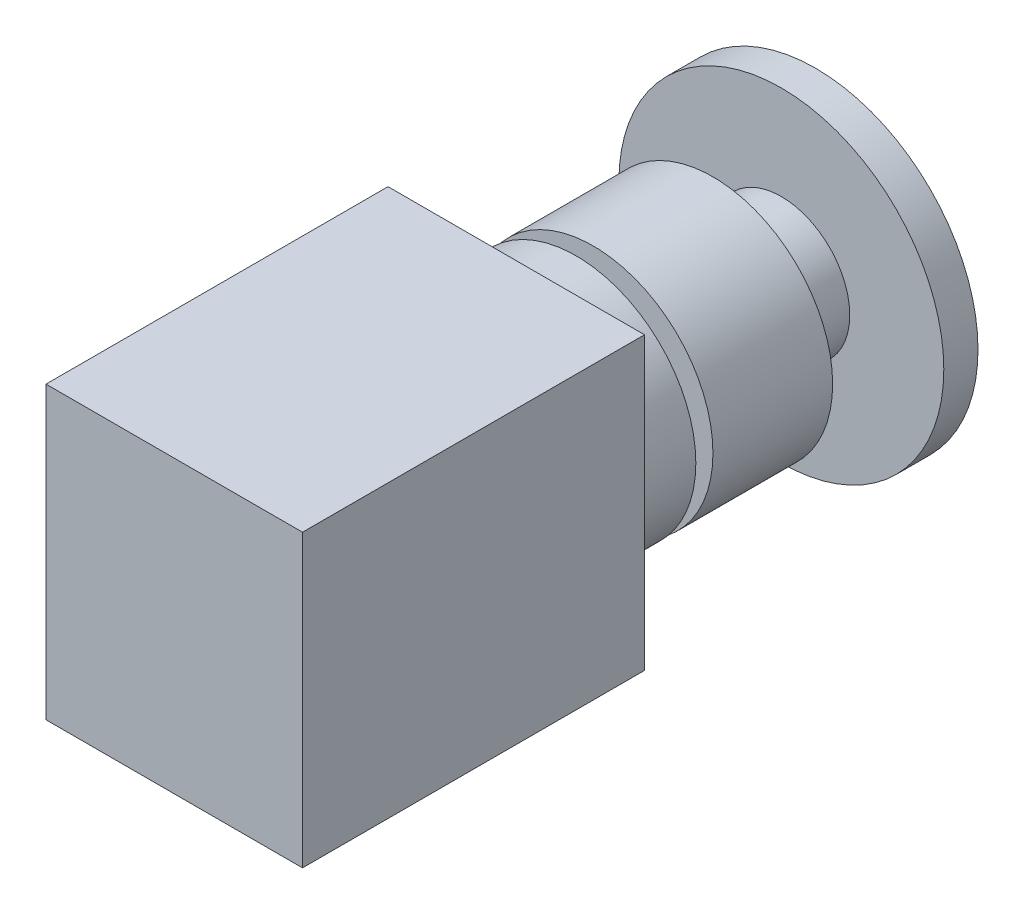
ISO-10303-21;
HEADER;
FILE_DESCRIPTION(('STEP AP214'),'2;1');
FILE_NAME('part.step','',(''),(''),'','','');
FILE_SCHEMA(('AUTOMOTIVE_DESIGN { 1 0 10303 214 1 1 1 1 }'));
ENDSEC;
DATA;
#1=APPLICATION_CONTEXT('core data for automotive mechanical design processes');
#2=APPLICATION_PROTOCOL_DEFINITION('international standard','automotive_design',2000,#1);
#3=PRODUCT_CONTEXT('',#1,'mechanical');
#4=PRODUCT('Part','Part','',(#3));
#5=PRODUCT_RELATED_PRODUCT_CATEGORY('part','',(#4));
#6=PRODUCT_DEFINITION_FORMATION('','',#4);
#7=PRODUCT_DEFINITION_CONTEXT('part definition',#1,'design');
#8=PRODUCT_DEFINITION('design','',#6,#7);
#9=PRODUCT_DEFINITION_SHAPE('','',#8);
#10=(LENGTH_UNIT() NAMED_UNIT(*) SI_UNIT(.MILLI.,.METRE.));
#11=(NAMED_UNIT(*) PLANE_ANGLE_UNIT() SI_UNIT($,.RADIAN.));
#12=(NAMED_UNIT(*) SI_UNIT($,.STERADIAN.) SOLID_ANGLE_UNIT());
#13=UNCERTAINTY_MEASURE_WITH_UNIT(LENGTH_MEASURE(1.E-05),#10,'distance_accuracy_value','');
#14=(GEOMETRIC_REPRESENTATION_CONTEXT(3) GLOBAL_UNCERTAINTY_ASSIGNED_CONTEXT((#13)) GLOBAL_UNIT_ASSIGNED_CONTEXT((#10,
#11,#12)) REPRESENTATION_CONTEXT('',''));
#15=CARTESIAN_POINT('',(0.,0.,0.));
#16=DIRECTION('',(0.,0.,1.));
#17=DIRECTION('',(1.,0.,0.));
#18=AXIS2_PLACEMENT_3D('',#15,#16,#17);
#19=CARTESIAN_POINT('',(0.,0.,4.));
#20=DIRECTION('',(0.,0.,-1.));
#21=DIRECTION('',(-1.,0.,0.));
#22=AXIS2_PLACEMENT_3D('',#19,#20,#21);
#23=CYLINDRICAL_SURFACE('',#22,19.);
#24=CARTESIAN_POINT('',(0.,0.,4.));
#25=DIRECTION('',(0.,0.,1.));
#26=DIRECTION('',(1.,0.,0.));
#27=AXIS2_PLACEMENT_3D('',#24,#25,#26);
#28=CIRCLE('',#27,19.);
#29=CARTESIAN_POINT('',(19.,0.,4.));
#30=VERTEX_POINT('',#29);
#31=EDGE_CURVE('E11',#30,#30,#28,.T.);
#32=ORIENTED_EDGE('',*,*,#31,.F.);
#33=EDGE_LOOP('',(#32));
#34=FACE_BOUND('',#33,.T.);
#35=CARTESIAN_POINT('',(0.,0.,0.));
#36=DIRECTION('',(0.,0.,1.));
#37=DIRECTION('',(1.,0.,0.));
#38=AXIS2_PLACEMENT_3D('',#35,#36,#37);
#39=CIRCLE('',#38,19.);
#40=CARTESIAN_POINT('',(19.,0.,0.));
#41=VERTEX_POINT('',#40);
#42=EDGE_CURVE('E38',#41,#41,#39,.T.);
#43=ORIENTED_EDGE('',*,*,#42,.T.);
#44=EDGE_LOOP('',(#43));
#45=FACE_BOUND('',#44,.T.);
#46=ADVANCED_FACE('F35',(#34,#45),#23,.T.);
#47=CARTESIAN_POINT('',(0.,0.,4.));
#48=DIRECTION('',(0.,0.,1.));
#49=DIRECTION('',(1.,0.,0.));
#50=AXIS2_PLACEMENT_3D('',#47,#48,#49);
#51=PLANE('',#50);
#52=CARTESIAN_POINT('',(0.,0.,4.));
#53=DIRECTION('',(0.,0.,1.));
#54=DIRECTION('',(1.,0.,0.));
#55=AXIS2_PLACEMENT_3D('',#52,#53,#54);
#56=CIRCLE('',#55,8.);
#57=CARTESIAN_POINT('',(8.,0.,4.));
#58=VERTEX_POINT('',#57);
#59=EDGE_CURVE('E127',#58,#58,#56,.T.);
#60=ORIENTED_EDGE('',*,*,#59,.F.);
#61=EDGE_LOOP('',(#60));
#62=FACE_BOUND('',#61,.T.);
#63=ORIENTED_EDGE('',*,*,#31,.T.);
#64=EDGE_LOOP('',(#63));
#65=FACE_BOUND('',#64,.T.);
#66=ADVANCED_FACE('F138',(#62,#65),#51,.T.);
#67=CARTESIAN_POINT('',(0.,0.,0.));
#68=DIRECTION('',(0.,0.,1.));
#69=DIRECTION('',(1.,0.,0.));
#70=AXIS2_PLACEMENT_3D('',#67,#68,#69);
#71=PLANE('',#70);
#72=ORIENTED_EDGE('',*,*,#42,.F.);
#73=EDGE_LOOP('',(#72));
#74=FACE_BOUND('',#73,.T.);
#75=ADVANCED_FACE('F141',(#74),#71,.F.);
#76=CARTESIAN_POINT('',(0.,0.,12.));
#77=DIRECTION('',(0.,0.,-1.));
#78=DIRECTION('',(-1.,0.,0.));
#79=AXIS2_PLACEMENT_3D('',#76,#77,#78);
#80=CYLINDRICAL_SURFACE('',#79,8.);
#81=CARTESIAN_POINT('',(0.,0.,12.));
#82=DIRECTION('',(0.,0.,1.));
#83=DIRECTION('',(1.,0.,0.));
#84=AXIS2_PLACEMENT_3D('',#81,#82,#83);
#85=CIRCLE('',#84,8.);
#86=CARTESIAN_POINT('',(8.,0.,12.));
#87=VERTEX_POINT('',#86);
#88=EDGE_CURVE('E130',#87,#87,#85,.T.);
#89=ORIENTED_EDGE('',*,*,#88,.F.);
#90=EDGE_LOOP('',(#89));
#91=FACE_BOUND('',#90,.T.);
#92=ORIENTED_EDGE('',*,*,#59,.T.);
#93=EDGE_LOOP('',(#92));
#94=FACE_BOUND('',#93,.T.);
#95=ADVANCED_FACE('F136',(#91,#94),#80,.T.);
#96=CARTESIAN_POINT('',(0.,0.,26.));
#97=DIRECTION('',(0.,0.,-1.));
#98=DIRECTION('',(-1.,0.,0.));
#99=AXIS2_PLACEMENT_3D('',#96,#97,#98);
#100=CYLINDRICAL_SURFACE('',#99,14.);
#101=CARTESIAN_POINT('',(0.,0.,26.));
#102=DIRECTION('',(0.,0.,1.));
#103=DIRECTION('',(1.,0.,0.));
#104=AXIS2_PLACEMENT_3D('',#101,#102,#103);
#105=CIRCLE('',#104,14.);
#106=CARTESIAN_POINT('',(14.,0.,26.));
#107=VERTEX_POINT('',#106);
#108=EDGE_CURVE('E124',#107,#107,#105,.T.);
#109=ORIENTED_EDGE('',*,*,#108,.F.);
#110=EDGE_LOOP('',(#109));
#111=FACE_BOUND('',#110,.T.);
#112=CARTESIAN_POINT('',(0.,0.,12.));
#113=DIRECTION('',(0.,0.,1.));
#114=DIRECTION('',(1.,0.,0.));
#115=AXIS2_PLACEMENT_3D('',#112,#113,#114);
#116=CIRCLE('',#115,14.);
#117=CARTESIAN_POINT('',(14.,0.,12.));
#118=VERTEX_POINT('',#117);
#119=EDGE_CURVE('E121',#118,#118,#116,.T.);
#120=ORIENTED_EDGE('',*,*,#119,.T.);
#121=EDGE_LOOP('',(#120));
#122=FACE_BOUND('',#121,.T.);
#123=ADVANCED_FACE('F154',(#111,#122),#100,.T.);
#124=CARTESIAN_POINT('',(0.,0.,26.));
#125=DIRECTION('',(0.,0.,1.));
#126=DIRECTION('',(1.,0.,0.));
#127=AXIS2_PLACEMENT_3D('',#124,#125,#126);
#128=PLANE('',#127);
#129=CARTESIAN_POINT('',(0.,0.,26.));
#130=DIRECTION('',(0.,0.,1.));
#131=DIRECTION('',(1.,0.,0.));
#132=AXIS2_PLACEMENT_3D('',#129,#130,#131);
#133=CIRCLE('',#132,11.);
#134=CARTESIAN_POINT('',(11.,0.,26.));
#135=VERTEX_POINT('',#134);
#136=EDGE_CURVE('E115',#135,#135,#133,.T.);
#137=ORIENTED_EDGE('',*,*,#136,.F.);
#138=EDGE_LOOP('',(#137));
#139=FACE_BOUND('',#138,.T.);
#140=ORIENTED_EDGE('',*,*,#108,.T.);
#141=EDGE_LOOP('',(#140));
#142=FACE_BOUND('',#141,.T.);
#143=ADVANCED_FACE('F160',(#139,#142),#128,.T.);
#144=CARTESIAN_POINT('',(0.,0.,12.));
#145=DIRECTION('',(0.,0.,1.));
#146=DIRECTION('',(1.,0.,0.));
#147=AXIS2_PLACEMENT_3D('',#144,#145,#146);
#148=PLANE('',#147);
#149=ORIENTED_EDGE('',*,*,#88,.T.);
#150=EDGE_LOOP('',(#149));
#151=FACE_BOUND('',#150,.T.);
#152=ORIENTED_EDGE('',*,*,#119,.F.);
#153=EDGE_LOOP('',(#152));
#154=FACE_BOUND('',#153,.T.);
#155=ADVANCED_FACE('F162',(#151,#154),#148,.F.);
#156=CARTESIAN_POINT('',(0.,0.,28.));
#157=DIRECTION('',(0.,0.,-1.));
#158=DIRECTION('',(-1.,0.,0.));
#159=AXIS2_PLACEMENT_3D('',#156,#157,#158);
#160=CYLINDRICAL_SURFACE('',#159,11.);
#161=CARTESIAN_POINT('',(0.,0.,28.));
#162=DIRECTION('',(0.,0.,1.));
#163=DIRECTION('',(1.,0.,0.));
#164=AXIS2_PLACEMENT_3D('',#161,#162,#163);
#165=CIRCLE('',#164,11.);
#166=CARTESIAN_POINT('',(11.,0.,28.));
#167=VERTEX_POINT('',#166);
#168=EDGE_CURVE('E118',#167,#167,#165,.T.);
#169=ORIENTED_EDGE('',*,*,#168,.F.);
#170=EDGE_LOOP('',(#169));
#171=FACE_BOUND('',#170,.T.);
#172=ORIENTED_EDGE('',*,*,#136,.T.);
#173=EDGE_LOOP('',(#172));
#174=FACE_BOUND('',#173,.T.);
#175=ADVANCED_FACE('F165',(#171,#174),#160,.T.);
#176=CARTESIAN_POINT('',(0.,0.,35.));
#177=DIRECTION('',(0.,0.,-1.));
#178=DIRECTION('',(-1.,0.,0.));
#179=AXIS2_PLACEMENT_3D('',#176,#177,#178);
#180=CYLINDRICAL_SURFACE('',#179,14.);
#181=CARTESIAN_POINT('',(0.,0.,35.));
#182=DIRECTION('',(0.,0.,1.));
#183=DIRECTION('',(1.,0.,0.));
#184=AXIS2_PLACEMENT_3D('',#181,#182,#183);
#185=CIRCLE('',#184,14.);
#186=CARTESIAN_POINT('',(14.,0.,35.));
#187=VERTEX_POINT('',#186);
#188=EDGE_CURVE('E112',#187,#187,#185,.T.);
#189=ORIENTED_EDGE('',*,*,#188,.F.);
#190=EDGE_LOOP('',(#189));
#191=FACE_BOUND('',#190,.T.);
#192=CARTESIAN_POINT('',(0.,0.,28.));
#193=DIRECTION('',(0.,0.,1.));
#194=DIRECTION('',(1.,0.,0.));
#195=AXIS2_PLACEMENT_3D('',#192,#193,#194);
#196=CIRCLE('',#195,14.);
#197=CARTESIAN_POINT('',(14.,0.,28.));
#198=VERTEX_POINT('',#197);
#199=EDGE_CURVE('E111',#198,#198,#196,.T.);
#200=ORIENTED_EDGE('',*,*,#199,.T.);
#201=EDGE_LOOP('',(#200));
#202=FACE_BOUND('',#201,.T.);
#203=ADVANCED_FACE('F172',(#191,#202),#180,.T.);
#204=CARTESIAN_POINT('',(0.,0.,28.));
#205=DIRECTION('',(0.,0.,1.));
#206=DIRECTION('',(1.,0.,0.));
#207=AXIS2_PLACEMENT_3D('',#204,#205,#206);
#208=PLANE('',#207);
#209=ORIENTED_EDGE('',*,*,#168,.T.);
#210=EDGE_LOOP('',(#209));
#211=FACE_BOUND('',#210,.T.);
#212=ORIENTED_EDGE('',*,*,#199,.F.);
#213=EDGE_LOOP('',(#212));
#214=FACE_BOUND('',#213,.T.);
#215=ADVANCED_FACE('F176',(#211,#214),#208,.F.);
#216=CARTESIAN_POINT('',(15.,17.,75.));
#217=DIRECTION('',(-1.,0.,0.));
#218=DIRECTION('',(0.,-1.,0.));
#219=AXIS2_PLACEMENT_3D('',#216,#217,#218);
#220=PLANE('',#219);
#221=DIRECTION('',(0.,1.,0.));
#222=VECTOR('',#221,1.);
#223=CARTESIAN_POINT('',(15.,17.,35.));
#224=LINE('',#223,#222);
#225=CARTESIAN_POINT('',(15.,-17.,35.));
#226=VERTEX_POINT('',#225);
#227=CARTESIAN_POINT('',(15.,17.,35.));
#228=VERTEX_POINT('',#227);
#229=EDGE_CURVE('E102',#226,#228,#224,.T.);
#230=ORIENTED_EDGE('',*,*,#229,.T.);
#231=DIRECTION('',(0.,0.,-1.));
#232=VECTOR('',#231,1.);
#233=CARTESIAN_POINT('',(15.,17.,75.));
#234=LINE('',#233,#232);
#235=CARTESIAN_POINT('',(15.,17.,75.));
#236=VERTEX_POINT('',#235);
#237=EDGE_CURVE('E93',#236,#228,#234,.T.);
#238=ORIENTED_EDGE('',*,*,#237,.F.);
#239=DIRECTION('',(0.,1.,0.));
#240=VECTOR('',#239,1.);
#241=CARTESIAN_POINT('',(15.,17.,75.));
#242=LINE('',#241,#240);
#243=CARTESIAN_POINT('',(15.,-17.,75.));
#244=VERTEX_POINT('',#243);
#245=EDGE_CURVE('E87',#244,#236,#242,.T.);
#246=ORIENTED_EDGE('',*,*,#245,.F.);
#247=DIRECTION('',(0.,0.,-1.));
#248=VECTOR('',#247,1.);
#249=CARTESIAN_POINT('',(15.,-17.,75.));
#250=LINE('',#249,#248);
#251=EDGE_CURVE('E98',#244,#226,#250,.T.);
#252=ORIENTED_EDGE('',*,*,#251,.T.);
#253=EDGE_LOOP('',(#230,#238,#246,#252));
#254=FACE_BOUND('',#253,.T.);
#255=ADVANCED_FACE('F180',(#254),#220,.F.);
#256=CARTESIAN_POINT('',(-15.,17.,75.));
#257=DIRECTION('',(0.,-1.,0.));
#258=DIRECTION('',(0.,0.,-1.));
#259=AXIS2_PLACEMENT_3D('',#256,#257,#258);
#260=PLANE('',#259);
#261=DIRECTION('',(-1.,0.,0.));
#262=VECTOR('',#261,1.);
#263=CARTESIAN_POINT('',(-15.,17.,35.));
#264=LINE('',#263,#262);
#265=CARTESIAN_POINT('',(-15.,17.,35.));
#266=VERTEX_POINT('',#265);
#267=EDGE_CURVE('E92',#228,#266,#264,.T.);
#268=ORIENTED_EDGE('',*,*,#267,.T.);
#269=DIRECTION('',(0.,0.,-1.));
#270=VECTOR('',#269,1.);
#271=CARTESIAN_POINT('',(-15.,17.,75.));
#272=LINE('',#271,#270);
#273=CARTESIAN_POINT('',(-15.,17.,75.));
#274=VERTEX_POINT('',#273);
#275=EDGE_CURVE('E90',#274,#266,#272,.T.);
#276=ORIENTED_EDGE('',*,*,#275,.F.);
#277=DIRECTION('',(-1.,0.,0.));
#278=VECTOR('',#277,1.);
#279=CARTESIAN_POINT('',(-15.,17.,75.));
#280=LINE('',#279,#278);
#281=EDGE_CURVE('E82',#236,#274,#280,.T.);
#282=ORIENTED_EDGE('',*,*,#281,.F.);
#283=ORIENTED_EDGE('',*,*,#237,.T.);
#284=EDGE_LOOP('',(#268,#276,#282,#283));
#285=FACE_BOUND('',#284,.T.);
#286=ADVANCED_FACE('F91',(#285),#260,.F.);
#287=CARTESIAN_POINT('',(-15.,17.,75.));
#288=DIRECTION('',(1.,0.,0.));
#289=DIRECTION('',(0.,1.,0.));
#290=AXIS2_PLACEMENT_3D('',#287,#288,#289);
#291=PLANE('',#290);
#292=DIRECTION('',(0.,-1.,0.));
#293=VECTOR('',#292,1.);
#294=CARTESIAN_POINT('',(-15.,17.,35.));
#295=LINE('',#294,#293);
#296=CARTESIAN_POINT('',(-15.,-17.,35.));
#297=VERTEX_POINT('',#296);
#298=EDGE_CURVE('E68',#266,#297,#295,.T.);
#299=ORIENTED_EDGE('',*,*,#298,.T.);
#300=DIRECTION('',(0.,0.,-1.));
#301=VECTOR('',#300,1.);
#302=CARTESIAN_POINT('',(-15.,-17.,75.));
#303=LINE('',#302,#301);
#304=CARTESIAN_POINT('',(-15.,-17.,75.));
#305=VERTEX_POINT('',#304);
#306=EDGE_CURVE('E94',#305,#297,#303,.T.);
#307=ORIENTED_EDGE('',*,*,#306,.F.);
#308=DIRECTION('',(0.,-1.,0.));
#309=VECTOR('',#308,1.);
#310=CARTESIAN_POINT('',(-15.,17.,75.));
#311=LINE('',#310,#309);
#312=EDGE_CURVE('E85',#274,#305,#311,.T.);
#313=ORIENTED_EDGE('',*,*,#312,.F.);
#314=ORIENTED_EDGE('',*,*,#275,.T.);
#315=EDGE_LOOP('',(#299,#307,#313,#314));
#316=FACE_BOUND('',#315,.T.);
#317=ADVANCED_FACE('F96',(#316),#291,.F.);
#318=CARTESIAN_POINT('',(-15.,-17.,75.));
#319=DIRECTION('',(0.,1.,0.));
#320=DIRECTION('',(0.,0.,1.));
#321=AXIS2_PLACEMENT_3D('',#318,#319,#320);
#322=PLANE('',#321);
#323=DIRECTION('',(1.,0.,0.));
#324=VECTOR('',#323,1.);
#325=CARTESIAN_POINT('',(-15.,-17.,35.));
#326=LINE('',#325,#324);
#327=EDGE_CURVE('E74',#297,#226,#326,.T.);
#328=ORIENTED_EDGE('',*,*,#327,.T.);
#329=ORIENTED_EDGE('',*,*,#251,.F.);
#330=DIRECTION('',(1.,0.,0.));
#331=VECTOR('',#330,1.);
#332=CARTESIAN_POINT('',(-15.,-17.,75.));
#333=LINE('',#332,#331);
#334=EDGE_CURVE('E51',#305,#244,#333,.T.);
#335=ORIENTED_EDGE('',*,*,#334,.F.);
#336=ORIENTED_EDGE('',*,*,#306,.T.);
#337=EDGE_LOOP('',(#328,#329,#335,#336));
#338=FACE_BOUND('',#337,.T.);
#339=ADVANCED_FACE('F189',(#338),#322,.F.);
#340=CARTESIAN_POINT('',(0.,0.,75.));
#341=DIRECTION('',(0.,0.,1.));
#342=DIRECTION('',(1.,0.,0.));
#343=AXIS2_PLACEMENT_3D('',#340,#341,#342);
#344=PLANE('',#343);
#345=ORIENTED_EDGE('',*,*,#245,.T.);
#346=ORIENTED_EDGE('',*,*,#281,.T.);
#347=ORIENTED_EDGE('',*,*,#312,.T.);
#348=ORIENTED_EDGE('',*,*,#334,.T.);
#349=EDGE_LOOP('',(#345,#346,#347,#348));
#350=FACE_BOUND('',#349,.T.);
#351=ADVANCED_FACE('F83',(#350),#344,.T.);
#352=CARTESIAN_POINT('',(0.,0.,35.));
#353=DIRECTION('',(0.,0.,1.));
#354=DIRECTION('',(1.,0.,0.));
#355=AXIS2_PLACEMENT_3D('',#352,#353,#354);
#356=PLANE('',#355);
#357=ORIENTED_EDGE('',*,*,#188,.T.);
#358=EDGE_LOOP('',(#357));
#359=FACE_BOUND('',#358,.T.);
#360=ORIENTED_EDGE('',*,*,#229,.F.);
#361=ORIENTED_EDGE('',*,*,#327,.F.);
#362=ORIENTED_EDGE('',*,*,#298,.F.);
#363=ORIENTED_EDGE('',*,*,#267,.F.);
#364=EDGE_LOOP('',(#360,#361,#362,#363));
#365=FACE_BOUND('',#364,.T.);
#366=ADVANCED_FACE('F192',(#359,#365),#356,.F.);
#367=CLOSED_SHELL('',(#46,#66,#75,#95,#123,#143,#155,#175,#203,#215,#255,#286,#317,#339,#351,#366));
#368=MANIFOLD_SOLID_BREP('B2',#367);
#369=ADVANCED_BREP_SHAPE_REPRESENTATION('',(#18,#368),#14);
#370=SHAPE_DEFINITION_REPRESENTATION(#9,#369);
ENDSEC;
END-ISO-10303-21;
